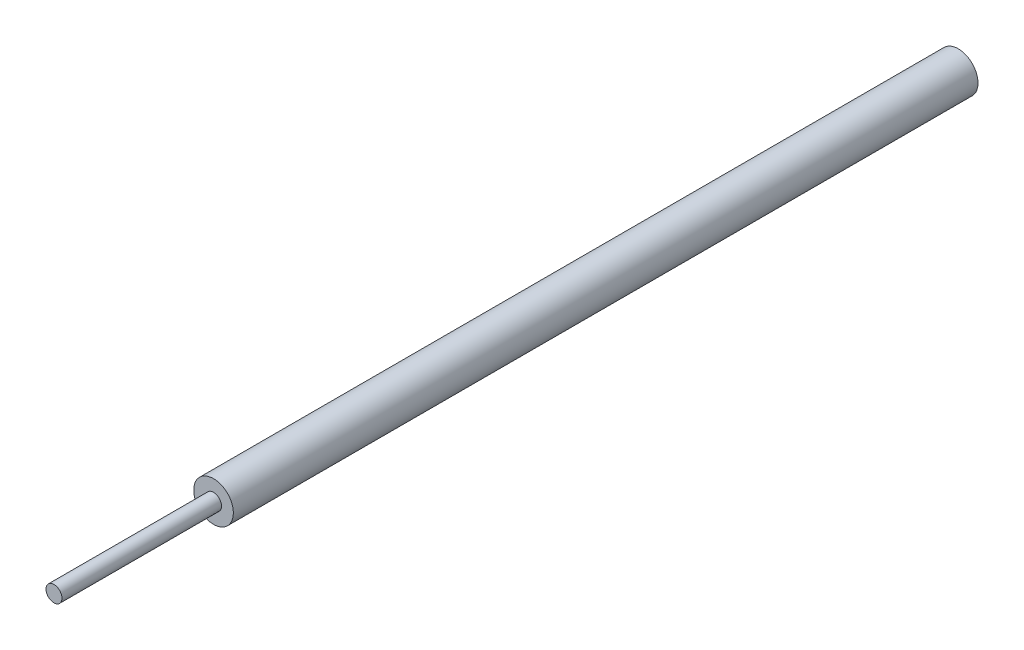
ISO-10303-21;
HEADER;
FILE_DESCRIPTION(('STEP AP214'),'2;1');
FILE_NAME('part.step','',(''),(''),'','','');
FILE_SCHEMA(('AUTOMOTIVE_DESIGN { 1 0 10303 214 1 1 1 1 }'));
ENDSEC;
DATA;
#1=APPLICATION_CONTEXT('core data for automotive mechanical design processes');
#2=APPLICATION_PROTOCOL_DEFINITION('international standard','automotive_design',2000,#1);
#3=PRODUCT_CONTEXT('',#1,'mechanical');
#4=PRODUCT('Part','Part','',(#3));
#5=PRODUCT_RELATED_PRODUCT_CATEGORY('part','',(#4));
#6=PRODUCT_DEFINITION_FORMATION('','',#4);
#7=PRODUCT_DEFINITION_CONTEXT('part definition',#1,'design');
#8=PRODUCT_DEFINITION('design','',#6,#7);
#9=PRODUCT_DEFINITION_SHAPE('','',#8);
#10=(LENGTH_UNIT() NAMED_UNIT(*) SI_UNIT(.MILLI.,.METRE.));
#11=(NAMED_UNIT(*) PLANE_ANGLE_UNIT() SI_UNIT($,.RADIAN.));
#12=(NAMED_UNIT(*) SI_UNIT($,.STERADIAN.) SOLID_ANGLE_UNIT());
#13=UNCERTAINTY_MEASURE_WITH_UNIT(LENGTH_MEASURE(1.E-05),#10,'distance_accuracy_value','');
#14=(GEOMETRIC_REPRESENTATION_CONTEXT(3) GLOBAL_UNCERTAINTY_ASSIGNED_CONTEXT((#13)) GLOBAL_UNIT_ASSIGNED_CONTEXT((#10,
#11,#12)) REPRESENTATION_CONTEXT('',''));
#15=CARTESIAN_POINT('',(0.,0.,0.));
#16=DIRECTION('',(0.,0.,1.));
#17=DIRECTION('',(1.,0.,0.));
#18=AXIS2_PLACEMENT_3D('',#15,#16,#17);
#19=CARTESIAN_POINT('',(0.,0.,140.));
#20=DIRECTION('',(0.,0.,-1.));
#21=DIRECTION('',(-1.,0.,0.));
#22=AXIS2_PLACEMENT_3D('',#19,#20,#21);
#23=CYLINDRICAL_SURFACE('',#22,3.725);
#24=CARTESIAN_POINT('',(0.,0.,140.));
#25=DIRECTION('',(0.,0.,1.));
#26=DIRECTION('',(1.,0.,0.));
#27=AXIS2_PLACEMENT_3D('',#24,#25,#26);
#28=CIRCLE('',#27,3.725);
#29=CARTESIAN_POINT('',(3.725,0.,140.));
#30=VERTEX_POINT('',#29);
#31=EDGE_CURVE('E38',#30,#30,#28,.T.);
#32=ORIENTED_EDGE('',*,*,#31,.F.);
#33=EDGE_LOOP('',(#32));
#34=FACE_BOUND('',#33,.T.);
#35=CARTESIAN_POINT('',(0.,0.,0.));
#36=DIRECTION('',(0.,0.,1.));
#37=DIRECTION('',(1.,0.,0.));
#38=AXIS2_PLACEMENT_3D('',#35,#36,#37);
#39=CIRCLE('',#38,3.725);
#40=CARTESIAN_POINT('',(3.725,0.,0.));
#41=VERTEX_POINT('',#40);
#42=EDGE_CURVE('E34',#41,#41,#39,.T.);
#43=ORIENTED_EDGE('',*,*,#42,.T.);
#44=EDGE_LOOP('',(#43));
#45=FACE_BOUND('',#44,.T.);
#46=ADVANCED_FACE('F31',(#34,#45),#23,.T.);
#47=CARTESIAN_POINT('',(0.,0.,140.));
#48=DIRECTION('',(0.,0.,1.));
#49=DIRECTION('',(1.,0.,0.));
#50=AXIS2_PLACEMENT_3D('',#47,#48,#49);
#51=PLANE('',#50);
#52=CARTESIAN_POINT('',(0.,0.,140.));
#53=DIRECTION('',(0.,0.,1.));
#54=DIRECTION('',(1.,0.,0.));
#55=AXIS2_PLACEMENT_3D('',#52,#53,#54);
#56=CIRCLE('',#55,1.5);
#57=CARTESIAN_POINT('',(1.5,0.,140.));
#58=VERTEX_POINT('',#57);
#59=EDGE_CURVE('E10',#58,#58,#56,.T.);
#60=ORIENTED_EDGE('',*,*,#59,.F.);
#61=EDGE_LOOP('',(#60));
#62=FACE_BOUND('',#61,.T.);
#63=ORIENTED_EDGE('',*,*,#31,.T.);
#64=EDGE_LOOP('',(#63));
#65=FACE_BOUND('',#64,.T.);
#66=ADVANCED_FACE('F55',(#62,#65),#51,.T.);
#67=CARTESIAN_POINT('',(0.,0.,0.));
#68=DIRECTION('',(0.,0.,1.));
#69=DIRECTION('',(1.,0.,0.));
#70=AXIS2_PLACEMENT_3D('',#67,#68,#69);
#71=PLANE('',#70);
#72=ORIENTED_EDGE('',*,*,#42,.F.);
#73=EDGE_LOOP('',(#72));
#74=FACE_BOUND('',#73,.T.);
#75=ADVANCED_FACE('F52',(#74),#71,.F.);
#76=CARTESIAN_POINT('',(0.,0.,170.));
#77=DIRECTION('',(0.,0.,-1.));
#78=DIRECTION('',(-1.,0.,0.));
#79=AXIS2_PLACEMENT_3D('',#76,#77,#78);
#80=CYLINDRICAL_SURFACE('',#79,1.5);
#81=CARTESIAN_POINT('',(0.,0.,170.));
#82=DIRECTION('',(0.,0.,1.));
#83=DIRECTION('',(1.,0.,0.));
#84=AXIS2_PLACEMENT_3D('',#81,#82,#83);
#85=CIRCLE('',#84,1.5);
#86=CARTESIAN_POINT('',(1.5,0.,170.));
#87=VERTEX_POINT('',#86);
#88=EDGE_CURVE('E44',#87,#87,#85,.T.);
#89=ORIENTED_EDGE('',*,*,#88,.F.);
#90=EDGE_LOOP('',(#89));
#91=FACE_BOUND('',#90,.T.);
#92=ORIENTED_EDGE('',*,*,#59,.T.);
#93=EDGE_LOOP('',(#92));
#94=FACE_BOUND('',#93,.T.);
#95=ADVANCED_FACE('F54',(#91,#94),#80,.T.);
#96=CARTESIAN_POINT('',(0.,0.,170.));
#97=DIRECTION('',(0.,0.,1.));
#98=DIRECTION('',(1.,0.,0.));
#99=AXIS2_PLACEMENT_3D('',#96,#97,#98);
#100=PLANE('',#99);
#101=ORIENTED_EDGE('',*,*,#88,.T.);
#102=EDGE_LOOP('',(#101));
#103=FACE_BOUND('',#102,.T.);
#104=ADVANCED_FACE('F60',(#103),#100,.T.);
#105=CLOSED_SHELL('',(#46,#66,#75,#95,#104));
#106=MANIFOLD_SOLID_BREP('B2',#105);
#107=ADVANCED_BREP_SHAPE_REPRESENTATION('',(#18,#106),#14);
#108=SHAPE_DEFINITION_REPRESENTATION(#9,#107);
ENDSEC;
END-ISO-10303-21;
